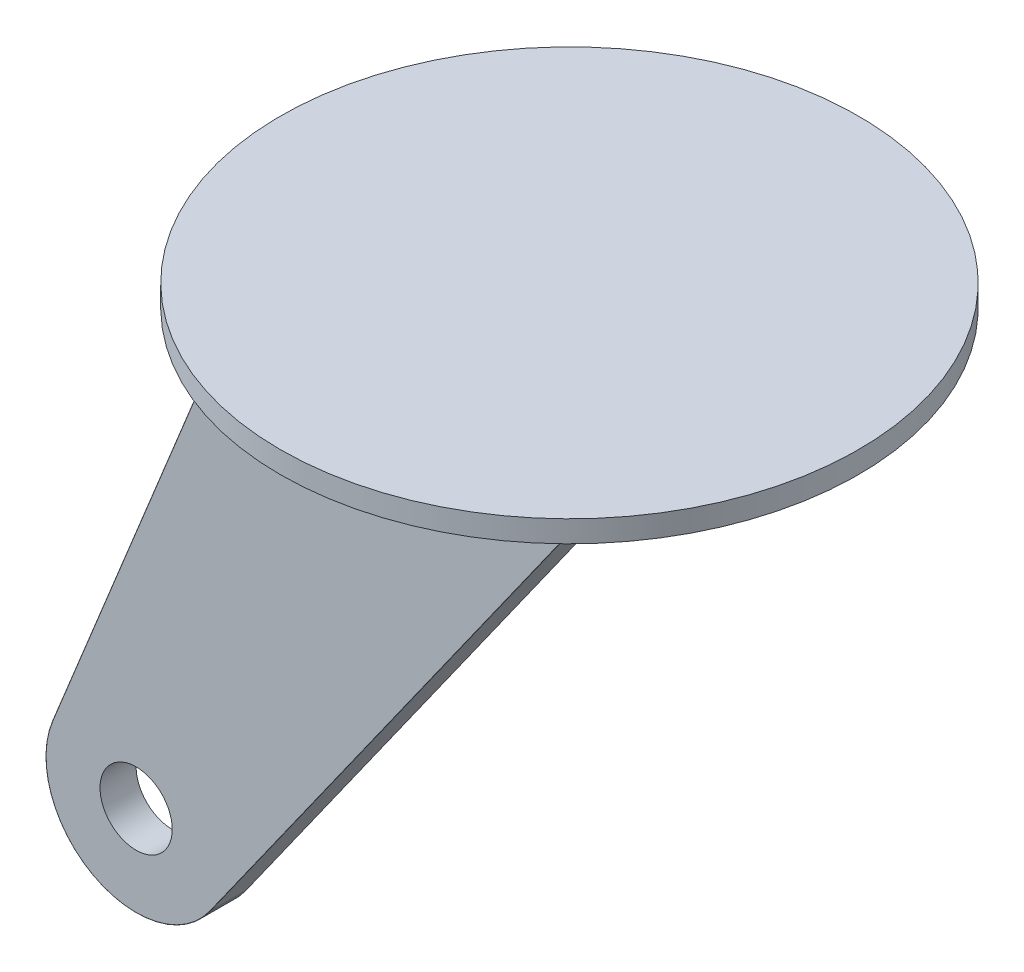
ISO-10303-21;
HEADER;
FILE_DESCRIPTION(('STEP AP214'),'2;1');
FILE_NAME('part.step','',(''),(''),'','','');
FILE_SCHEMA(('AUTOMOTIVE_DESIGN { 1 0 10303 214 1 1 1 1 }'));
ENDSEC;
DATA;
#1=APPLICATION_CONTEXT('core data for automotive mechanical design processes');
#2=APPLICATION_PROTOCOL_DEFINITION('international standard','automotive_design',2000,#1);
#3=PRODUCT_CONTEXT('',#1,'mechanical');
#4=PRODUCT('Part','Part','',(#3));
#5=PRODUCT_RELATED_PRODUCT_CATEGORY('part','',(#4));
#6=PRODUCT_DEFINITION_FORMATION('','',#4);
#7=PRODUCT_DEFINITION_CONTEXT('part definition',#1,'design');
#8=PRODUCT_DEFINITION('design','',#6,#7);
#9=PRODUCT_DEFINITION_SHAPE('','',#8);
#10=(LENGTH_UNIT() NAMED_UNIT(*) SI_UNIT(.MILLI.,.METRE.));
#11=(NAMED_UNIT(*) PLANE_ANGLE_UNIT() SI_UNIT($,.RADIAN.));
#12=(NAMED_UNIT(*) SI_UNIT($,.STERADIAN.) SOLID_ANGLE_UNIT());
#13=UNCERTAINTY_MEASURE_WITH_UNIT(LENGTH_MEASURE(1.E-05),#10,'distance_accuracy_value','');
#14=(GEOMETRIC_REPRESENTATION_CONTEXT(3) GLOBAL_UNCERTAINTY_ASSIGNED_CONTEXT((#13)) GLOBAL_UNIT_ASSIGNED_CONTEXT((#10,
#11,#12)) REPRESENTATION_CONTEXT('',''));
#15=CARTESIAN_POINT('',(0.,0.,0.));
#16=DIRECTION('',(0.,0.,1.));
#17=DIRECTION('',(1.,0.,0.));
#18=AXIS2_PLACEMENT_3D('',#15,#16,#17);
#19=CARTESIAN_POINT('',(0.,0.,0.));
#20=DIRECTION('',(0.,1.,0.));
#21=DIRECTION('',(0.,0.,1.));
#22=AXIS2_PLACEMENT_3D('',#19,#20,#21);
#23=PLANE('',#22);
#24=CARTESIAN_POINT('',(0.,0.,0.));
#25=DIRECTION('',(0.,1.,0.));
#26=DIRECTION('',(0.,0.,1.));
#27=AXIS2_PLACEMENT_3D('',#24,#25,#26);
#28=CIRCLE('',#27,1016.);
#29=CARTESIAN_POINT('',(0.,0.,1016.));
#30=VERTEX_POINT('',#29);
#31=EDGE_CURVE('E133',#30,#30,#28,.T.);
#32=ORIENTED_EDGE('',*,*,#31,.F.);
#33=EDGE_LOOP('',(#32));
#34=FACE_BOUND('',#33,.T.);
#35=DIRECTION('',(0.,0.,-1.));
#36=VECTOR('',#35,1.);
#37=CARTESIAN_POINT('',(-635.,0.,508.));
#38=LINE('',#37,#36);
#39=CARTESIAN_POINT('',(-635.,0.,507.));
#40=VERTEX_POINT('',#39);
#41=CARTESIAN_POINT('',(-635.,0.,382.));
#42=VERTEX_POINT('',#41);
#43=EDGE_CURVE('E172',#40,#42,#38,.T.);
#44=ORIENTED_EDGE('',*,*,#43,.F.);
#45=CARTESIAN_POINT('',(-633.920465821705,0.,507.));
#46=DIRECTION('',(0.,1.,0.));
#47=DIRECTION('',(1.,0.,0.));
#48=AXIS2_PLACEMENT_3D('',#45,#46,#47);
#49=ELLIPSE('',#48,1.07953417829496,1.);
#50=CARTESIAN_POINT('',(-633.920465821705,0.,508.));
#51=VERTEX_POINT('',#50);
#52=EDGE_CURVE('E11',#40,#51,#49,.T.);
#53=ORIENTED_EDGE('',*,*,#52,.T.);
#54=DIRECTION('',(-1.,0.,0.));
#55=VECTOR('',#54,1.);
#56=CARTESIAN_POINT('',(0.,0.,508.));
#57=LINE('',#56,#55);
#58=CARTESIAN_POINT('',(633.774004541412,0.,508.));
#59=VERTEX_POINT('',#58);
#60=EDGE_CURVE('E107',#59,#51,#57,.T.);
#61=ORIENTED_EDGE('',*,*,#60,.F.);
#62=CARTESIAN_POINT('',(633.774004541413,0.,507.));
#63=DIRECTION('',(0.,1.,0.));
#64=DIRECTION('',(-1.,0.,0.));
#65=AXIS2_PLACEMENT_3D('',#62,#63,#64);
#66=ELLIPSE('',#65,1.22599545858738,1.);
#67=CARTESIAN_POINT('',(635.,0.,507.));
#68=VERTEX_POINT('',#67);
#69=EDGE_CURVE('E103',#59,#68,#66,.T.);
#70=ORIENTED_EDGE('',*,*,#69,.T.);
#71=DIRECTION('',(0.,0.,-1.));
#72=VECTOR('',#71,1.);
#73=CARTESIAN_POINT('',(635.,0.,508.));
#74=LINE('',#73,#72);
#75=CARTESIAN_POINT('',(635.,0.,382.));
#76=VERTEX_POINT('',#75);
#77=EDGE_CURVE('E105',#68,#76,#74,.T.);
#78=ORIENTED_EDGE('',*,*,#77,.T.);
#79=CARTESIAN_POINT('',(633.774004541413,0.,382.));
#80=DIRECTION('',(0.,1.,0.));
#81=DIRECTION('',(1.,0.,0.));
#82=AXIS2_PLACEMENT_3D('',#79,#80,#81);
#83=ELLIPSE('',#82,1.22599545858738,1.);
#84=CARTESIAN_POINT('',(633.774004541413,0.,381.));
#85=VERTEX_POINT('',#84);
#86=EDGE_CURVE('E112',#76,#85,#83,.T.);
#87=ORIENTED_EDGE('',*,*,#86,.T.);
#88=DIRECTION('',(-1.,0.,0.));
#89=VECTOR('',#88,1.);
#90=CARTESIAN_POINT('',(0.,0.,381.));
#91=LINE('',#90,#89);
#92=CARTESIAN_POINT('',(-633.920465821705,0.,381.));
#93=VERTEX_POINT('',#92);
#94=EDGE_CURVE('E176',#85,#93,#91,.T.);
#95=ORIENTED_EDGE('',*,*,#94,.T.);
#96=CARTESIAN_POINT('',(-633.920465821705,0.,382.));
#97=DIRECTION('',(0.,1.,0.));
#98=DIRECTION('',(-1.,0.,0.));
#99=AXIS2_PLACEMENT_3D('',#96,#97,#98);
#100=ELLIPSE('',#99,1.07953417829496,1.);
#101=EDGE_CURVE('E46',#93,#42,#100,.T.);
#102=ORIENTED_EDGE('',*,*,#101,.T.);
#103=EDGE_LOOP('',(#44,#53,#61,#70,#78,#87,#95,#102));
#104=FACE_BOUND('',#103,.T.);
#105=ADVANCED_FACE('F37',(#34,#104),#23,.F.);
#106=CARTESIAN_POINT('',(0.,76.2,0.));
#107=DIRECTION('',(0.,-1.,0.));
#108=DIRECTION('',(0.,0.,-1.));
#109=AXIS2_PLACEMENT_3D('',#106,#107,#108);
#110=CYLINDRICAL_SURFACE('',#109,1016.);
#111=CARTESIAN_POINT('',(0.,76.2,0.));
#112=DIRECTION('',(0.,1.,0.));
#113=DIRECTION('',(0.,0.,1.));
#114=AXIS2_PLACEMENT_3D('',#111,#112,#113);
#115=CIRCLE('',#114,1016.);
#116=CARTESIAN_POINT('',(0.,76.2,1016.));
#117=VERTEX_POINT('',#116);
#118=EDGE_CURVE('E128',#117,#117,#115,.T.);
#119=ORIENTED_EDGE('',*,*,#118,.F.);
#120=EDGE_LOOP('',(#119));
#121=FACE_BOUND('',#120,.T.);
#122=ORIENTED_EDGE('',*,*,#31,.T.);
#123=EDGE_LOOP('',(#122));
#124=FACE_BOUND('',#123,.T.);
#125=ADVANCED_FACE('F191',(#121,#124),#110,.T.);
#126=CARTESIAN_POINT('',(0.,76.2,0.));
#127=DIRECTION('',(0.,1.,0.));
#128=DIRECTION('',(0.,0.,1.));
#129=AXIS2_PLACEMENT_3D('',#126,#127,#128);
#130=PLANE('',#129);
#131=ORIENTED_EDGE('',*,*,#118,.T.);
#132=EDGE_LOOP('',(#131));
#133=FACE_BOUND('',#132,.T.);
#134=ADVANCED_FACE('F198',(#133),#130,.T.);
#135=CARTESIAN_POINT('',(-1015.3367857407,-1778.,508.));
#136=DIRECTION('',(0.,0.,1.));
#137=DIRECTION('',(1.,0.,0.));
#138=AXIS2_PLACEMENT_3D('',#135,#136,#137);
#139=PLANE('',#138);
#140=CARTESIAN_POINT('',(-1015.3367857407,-1778.,508.));
#141=DIRECTION('',(0.,0.,1.));
#142=DIRECTION('',(1.,0.,0.));
#143=AXIS2_PLACEMENT_3D('',#140,#141,#142);
#144=CIRCLE('',#143,316.5);
#145=CARTESIAN_POINT('',(-1308.51879550336,-1658.76678670971,508.));
#146=VERTEX_POINT('',#145);
#147=CARTESIAN_POINT('',(-757.179222608547,-1961.10358433867,508.));
#148=VERTEX_POINT('',#147);
#149=EDGE_CURVE('E144',#146,#148,#144,.T.);
#150=ORIENTED_EDGE('',*,*,#149,.T.);
#151=DIRECTION('',(0.578526332823616,0.815663706578673,0.));
#152=VECTOR('',#151,1.);
#153=CARTESIAN_POINT('',(634.184336293422,0.578526332824403,508.));
#154=LINE('',#153,#152);
#155=EDGE_CURVE('E146',#148,#59,#154,.T.);
#156=ORIENTED_EDGE('',*,*,#155,.T.);
#157=ORIENTED_EDGE('',*,*,#60,.T.);
#158=DIRECTION('',(-0.376724212607538,-0.92632546528487,0.));
#159=VECTOR('',#158,1.);
#160=CARTESIAN_POINT('',(-1308.51879550336,-1658.76678670971,508.));
#161=LINE('',#160,#159);
#162=EDGE_CURVE('E142',#51,#146,#161,.T.);
#163=ORIENTED_EDGE('',*,*,#162,.T.);
#164=EDGE_LOOP('',(#150,#156,#157,#163));
#165=FACE_BOUND('',#164,.T.);
#166=CARTESIAN_POINT('',(-1015.3367857407,-1778.,508.));
#167=DIRECTION('',(0.,0.,1.));
#168=DIRECTION('',(1.,0.,0.));
#169=AXIS2_PLACEMENT_3D('',#166,#167,#168);
#170=CIRCLE('',#169,127.);
#171=CARTESIAN_POINT('',(-888.336785740697,-1778.,508.));
#172=VERTEX_POINT('',#171);
#173=EDGE_CURVE('E178',#172,#172,#170,.T.);
#174=ORIENTED_EDGE('',*,*,#173,.F.);
#175=EDGE_LOOP('',(#174));
#176=FACE_BOUND('',#175,.T.);
#177=ADVANCED_FACE('F174',(#165,#176),#139,.T.);
#178=CARTESIAN_POINT('',(-1015.3367857407,-1778.,381.));
#179=DIRECTION('',(0.,0.,1.));
#180=DIRECTION('',(1.,0.,0.));
#181=AXIS2_PLACEMENT_3D('',#178,#179,#180);
#182=PLANE('',#181);
#183=ORIENTED_EDGE('',*,*,#94,.F.);
#184=DIRECTION('',(0.578526332823616,0.815663706578673,0.));
#185=VECTOR('',#184,1.);
#186=CARTESIAN_POINT('',(-757.179222608547,-1961.10358433867,381.));
#187=LINE('',#186,#185);
#188=CARTESIAN_POINT('',(-757.179222608547,-1961.10358433867,381.));
#189=VERTEX_POINT('',#188);
#190=EDGE_CURVE('E140',#85,#189,#187,.F.);
#191=ORIENTED_EDGE('',*,*,#190,.T.);
#192=CARTESIAN_POINT('',(-1015.3367857407,-1778.,381.));
#193=DIRECTION('',(0.,0.,1.));
#194=DIRECTION('',(1.,0.,0.));
#195=AXIS2_PLACEMENT_3D('',#192,#193,#194);
#196=CIRCLE('',#195,316.5);
#197=CARTESIAN_POINT('',(-1308.51879550336,-1658.76678670971,381.));
#198=VERTEX_POINT('',#197);
#199=EDGE_CURVE('E138',#189,#198,#196,.F.);
#200=ORIENTED_EDGE('',*,*,#199,.T.);
#201=DIRECTION('',(-0.376724212607538,-0.92632546528487,0.));
#202=VECTOR('',#201,1.);
#203=CARTESIAN_POINT('',(-1308.51879550336,-1658.76678670971,381.));
#204=LINE('',#203,#202);
#205=EDGE_CURVE('E130',#198,#93,#204,.F.);
#206=ORIENTED_EDGE('',*,*,#205,.T.);
#207=EDGE_LOOP('',(#183,#191,#200,#206));
#208=FACE_BOUND('',#207,.T.);
#209=CARTESIAN_POINT('',(-1015.3367857407,-1778.,381.));
#210=DIRECTION('',(0.,0.,1.));
#211=DIRECTION('',(1.,0.,0.));
#212=AXIS2_PLACEMENT_3D('',#209,#210,#211);
#213=CIRCLE('',#212,127.);
#214=CARTESIAN_POINT('',(-888.336785740697,-1778.,381.));
#215=VERTEX_POINT('',#214);
#216=EDGE_CURVE('E162',#215,#215,#213,.T.);
#217=ORIENTED_EDGE('',*,*,#216,.T.);
#218=EDGE_LOOP('',(#217));
#219=FACE_BOUND('',#218,.T.);
#220=ADVANCED_FACE('F265',(#208,#219),#182,.F.);
#221=CARTESIAN_POINT('',(-635.,0.,508.));
#222=DIRECTION('',(0.92632546528487,-0.376724212607538,0.));
#223=DIRECTION('',(0.376724212607538,0.92632546528487,0.));
#224=AXIS2_PLACEMENT_3D('',#221,#222,#223);
#225=PLANE('',#224);
#226=ORIENTED_EDGE('',*,*,#43,.T.);
#227=DIRECTION('',(-0.376724212607538,-0.92632546528487,0.));
#228=VECTOR('',#227,1.);
#229=CARTESIAN_POINT('',(-635.,0.,382.));
#230=LINE('',#229,#228);
#231=CARTESIAN_POINT('',(-1309.44512096864,-1658.39006249711,382.));
#232=VERTEX_POINT('',#231);
#233=EDGE_CURVE('E153',#42,#232,#230,.T.);
#234=ORIENTED_EDGE('',*,*,#233,.T.);
#235=DIRECTION('',(0.,0.,-1.));
#236=VECTOR('',#235,1.);
#237=CARTESIAN_POINT('',(-1309.44512096864,-1658.39006249711,508.));
#238=LINE('',#237,#236);
#239=CARTESIAN_POINT('',(-1309.44512096864,-1658.39006249711,507.));
#240=VERTEX_POINT('',#239);
#241=EDGE_CURVE('E184',#240,#232,#238,.T.);
#242=ORIENTED_EDGE('',*,*,#241,.F.);
#243=DIRECTION('',(-0.376724212607538,-0.92632546528487,0.));
#244=VECTOR('',#243,1.);
#245=CARTESIAN_POINT('',(-635.,0.,507.));
#246=LINE('',#245,#244);
#247=EDGE_CURVE('E60',#240,#40,#246,.F.);
#248=ORIENTED_EDGE('',*,*,#247,.T.);
#249=EDGE_LOOP('',(#226,#234,#242,#248));
#250=FACE_BOUND('',#249,.T.);
#251=ADVANCED_FACE('F257',(#250),#225,.F.);
#252=CARTESIAN_POINT('',(-1015.3367857407,-1778.,508.));
#253=DIRECTION('',(0.,0.,-1.));
#254=DIRECTION('',(-1.,0.,0.));
#255=AXIS2_PLACEMENT_3D('',#252,#253,#254);
#256=CYLINDRICAL_SURFACE('',#255,317.5);
#257=DIRECTION('',(0.,0.,-1.));
#258=VECTOR('',#257,1.);
#259=CARTESIAN_POINT('',(-756.363558901968,-1961.6821106715,508.));
#260=LINE('',#259,#258);
#261=CARTESIAN_POINT('',(-756.363558901968,-1961.6821106715,507.));
#262=VERTEX_POINT('',#261);
#263=CARTESIAN_POINT('',(-756.363558901968,-1961.6821106715,382.));
#264=VERTEX_POINT('',#263);
#265=EDGE_CURVE('E122',#262,#264,#260,.T.);
#266=ORIENTED_EDGE('',*,*,#265,.F.);
#267=CARTESIAN_POINT('',(-1015.3367857407,-1778.,507.));
#268=DIRECTION('',(0.,0.,1.));
#269=DIRECTION('',(1.,0.,0.));
#270=AXIS2_PLACEMENT_3D('',#267,#268,#269);
#271=CIRCLE('',#270,317.5);
#272=EDGE_CURVE('E150',#262,#240,#271,.F.);
#273=ORIENTED_EDGE('',*,*,#272,.T.);
#274=ORIENTED_EDGE('',*,*,#241,.T.);
#275=CARTESIAN_POINT('',(-1015.3367857407,-1778.,382.));
#276=DIRECTION('',(0.,0.,1.));
#277=DIRECTION('',(1.,0.,0.));
#278=AXIS2_PLACEMENT_3D('',#275,#276,#277);
#279=CIRCLE('',#278,317.5);
#280=EDGE_CURVE('E148',#232,#264,#279,.T.);
#281=ORIENTED_EDGE('',*,*,#280,.T.);
#282=EDGE_LOOP('',(#266,#273,#274,#281));
#283=FACE_BOUND('',#282,.T.);
#284=ADVANCED_FACE('F250',(#283),#256,.T.);
#285=CARTESIAN_POINT('',(635.,0.,508.));
#286=DIRECTION('',(-0.815663706578672,0.578526332823616,0.));
#287=DIRECTION('',(-0.578526332823616,-0.815663706578673,0.));
#288=AXIS2_PLACEMENT_3D('',#285,#286,#287);
#289=PLANE('',#288);
#290=ORIENTED_EDGE('',*,*,#265,.T.);
#291=DIRECTION('',(0.578526332823616,0.815663706578673,0.));
#292=VECTOR('',#291,1.);
#293=CARTESIAN_POINT('',(635.,0.,382.));
#294=LINE('',#293,#292);
#295=EDGE_CURVE('E121',#264,#76,#294,.T.);
#296=ORIENTED_EDGE('',*,*,#295,.T.);
#297=ORIENTED_EDGE('',*,*,#77,.F.);
#298=DIRECTION('',(0.578526332823616,0.815663706578673,0.));
#299=VECTOR('',#298,1.);
#300=CARTESIAN_POINT('',(-756.363558901968,-1961.6821106715,507.));
#301=LINE('',#300,#299);
#302=EDGE_CURVE('E118',#68,#262,#301,.F.);
#303=ORIENTED_EDGE('',*,*,#302,.T.);
#304=EDGE_LOOP('',(#290,#296,#297,#303));
#305=FACE_BOUND('',#304,.T.);
#306=ADVANCED_FACE('F117',(#305),#289,.F.);
#307=CARTESIAN_POINT('',(-1015.3367857407,-1778.,508.));
#308=DIRECTION('',(0.,0.,-1.));
#309=DIRECTION('',(-1.,0.,0.));
#310=AXIS2_PLACEMENT_3D('',#307,#308,#309);
#311=CYLINDRICAL_SURFACE('',#310,127.);
#312=ORIENTED_EDGE('',*,*,#173,.T.);
#313=EDGE_LOOP('',(#312));
#314=FACE_BOUND('',#313,.T.);
#315=ORIENTED_EDGE('',*,*,#216,.F.);
#316=EDGE_LOOP('',(#315));
#317=FACE_BOUND('',#316,.T.);
#318=ADVANCED_FACE('F215',(#314,#317),#311,.F.);
#319=CARTESIAN_POINT('',(-634.073674534715,-0.376724212607616,382.));
#320=DIRECTION('',(-0.376724212607538,-0.92632546528487,0.));
#321=DIRECTION('',(0.92632546528487,-0.376724212607538,0.));
#322=AXIS2_PLACEMENT_3D('',#319,#320,#321);
#323=CYLINDRICAL_SURFACE('',#322,1.);
#324=ORIENTED_EDGE('',*,*,#101,.F.);
#325=ORIENTED_EDGE('',*,*,#205,.F.);
#326=CARTESIAN_POINT('',(-1308.51879550336,-1658.76678670971,382.));
#327=DIRECTION('',(-0.376724212607565,-0.926325465284859,0.));
#328=DIRECTION('',(0.926325465284859,-0.376724212607565,0.));
#329=AXIS2_PLACEMENT_3D('',#326,#327,#328);
#330=CIRCLE('',#329,1.);
#331=EDGE_CURVE('E160',#232,#198,#330,.T.);
#332=ORIENTED_EDGE('',*,*,#331,.F.);
#333=ORIENTED_EDGE('',*,*,#233,.F.);
#334=EDGE_LOOP('',(#324,#325,#332,#333));
#335=FACE_BOUND('',#334,.T.);
#336=ADVANCED_FACE('F211',(#335),#323,.T.);
#337=CARTESIAN_POINT('',(-1015.3367857407,-1778.,382.));
#338=DIRECTION('',(0.,0.,1.));
#339=DIRECTION('',(1.,0.,0.));
#340=AXIS2_PLACEMENT_3D('',#337,#338,#339);
#341=TOROIDAL_SURFACE('',#340,316.5,1.);
#342=ORIENTED_EDGE('',*,*,#331,.T.);
#343=ORIENTED_EDGE('',*,*,#199,.F.);
#344=CARTESIAN_POINT('',(-757.179222608547,-1961.10358433867,382.));
#345=DIRECTION('',(0.578526332823533,0.815663706578732,0.));
#346=DIRECTION('',(-0.815663706578732,0.578526332823533,0.));
#347=AXIS2_PLACEMENT_3D('',#344,#345,#346);
#348=CIRCLE('',#347,1.);
#349=EDGE_CURVE('E157',#264,#189,#348,.T.);
#350=ORIENTED_EDGE('',*,*,#349,.F.);
#351=ORIENTED_EDGE('',*,*,#280,.F.);
#352=EDGE_LOOP('',(#342,#343,#350,#351));
#353=FACE_BOUND('',#352,.T.);
#354=ADVANCED_FACE('F207',(#353),#341,.T.);
#355=CARTESIAN_POINT('',(634.184336293421,0.578526332823616,382.));
#356=DIRECTION('',(0.578526332823616,0.815663706578673,0.));
#357=DIRECTION('',(-0.815663706578672,0.578526332823616,0.));
#358=AXIS2_PLACEMENT_3D('',#355,#356,#357);
#359=CYLINDRICAL_SURFACE('',#358,1.);
#360=ORIENTED_EDGE('',*,*,#349,.T.);
#361=ORIENTED_EDGE('',*,*,#190,.F.);
#362=ORIENTED_EDGE('',*,*,#86,.F.);
#363=ORIENTED_EDGE('',*,*,#295,.F.);
#364=EDGE_LOOP('',(#360,#361,#362,#363));
#365=FACE_BOUND('',#364,.T.);
#366=ADVANCED_FACE('F204',(#365),#359,.T.);
#367=CARTESIAN_POINT('',(-1308.51879550336,-1658.76678670971,507.));
#368=DIRECTION('',(0.376724212607538,0.92632546528487,0.));
#369=DIRECTION('',(-0.92632546528487,0.376724212607538,0.));
#370=AXIS2_PLACEMENT_3D('',#367,#368,#369);
#371=CYLINDRICAL_SURFACE('',#370,1.);
#372=ORIENTED_EDGE('',*,*,#52,.F.);
#373=ORIENTED_EDGE('',*,*,#247,.F.);
#374=CARTESIAN_POINT('',(-1308.51879550336,-1658.76678670971,507.));
#375=DIRECTION('',(-0.376724212607565,-0.926325465284859,0.));
#376=DIRECTION('',(0.926325465284859,-0.376724212607565,0.));
#377=AXIS2_PLACEMENT_3D('',#374,#375,#376);
#378=CIRCLE('',#377,1.);
#379=EDGE_CURVE('E41',#146,#240,#378,.T.);
#380=ORIENTED_EDGE('',*,*,#379,.F.);
#381=ORIENTED_EDGE('',*,*,#162,.F.);
#382=EDGE_LOOP('',(#372,#373,#380,#381));
#383=FACE_BOUND('',#382,.T.);
#384=ADVANCED_FACE('F39',(#383),#371,.T.);
#385=CARTESIAN_POINT('',(-1015.3367857407,-1778.,507.));
#386=DIRECTION('',(0.,0.,1.));
#387=DIRECTION('',(1.,0.,0.));
#388=AXIS2_PLACEMENT_3D('',#385,#386,#387);
#389=TOROIDAL_SURFACE('',#388,316.5,1.);
#390=ORIENTED_EDGE('',*,*,#379,.T.);
#391=ORIENTED_EDGE('',*,*,#272,.F.);
#392=CARTESIAN_POINT('',(-757.179222608547,-1961.10358433867,507.));
#393=DIRECTION('',(0.578526332823585,0.815663706578694,0.));
#394=DIRECTION('',(-0.815663706578694,0.578526332823585,0.));
#395=AXIS2_PLACEMENT_3D('',#392,#393,#394);
#396=CIRCLE('',#395,1.);
#397=EDGE_CURVE('E127',#148,#262,#396,.T.);
#398=ORIENTED_EDGE('',*,*,#397,.F.);
#399=ORIENTED_EDGE('',*,*,#149,.F.);
#400=EDGE_LOOP('',(#390,#391,#398,#399));
#401=FACE_BOUND('',#400,.T.);
#402=ADVANCED_FACE('F168',(#401),#389,.T.);
#403=CARTESIAN_POINT('',(-757.179222608547,-1961.10358433867,507.));
#404=DIRECTION('',(-0.578526332823616,-0.815663706578673,0.));
#405=DIRECTION('',(0.815663706578672,-0.578526332823616,0.));
#406=AXIS2_PLACEMENT_3D('',#403,#404,#405);
#407=CYLINDRICAL_SURFACE('',#406,1.);
#408=ORIENTED_EDGE('',*,*,#397,.T.);
#409=ORIENTED_EDGE('',*,*,#302,.F.);
#410=ORIENTED_EDGE('',*,*,#69,.F.);
#411=ORIENTED_EDGE('',*,*,#155,.F.);
#412=EDGE_LOOP('',(#408,#409,#410,#411));
#413=FACE_BOUND('',#412,.T.);
#414=ADVANCED_FACE('F125',(#413),#407,.T.);
#415=CLOSED_SHELL('',(#105,#125,#134,#177,#220,#251,#284,#306,#318,#336,#354,#366,#384,#402,#414));
#416=MANIFOLD_SOLID_BREP('B2',#415);
#417=ADVANCED_BREP_SHAPE_REPRESENTATION('',(#18,#416),#14);
#418=SHAPE_DEFINITION_REPRESENTATION(#9,#417);
ENDSEC;
END-ISO-10303-21;
